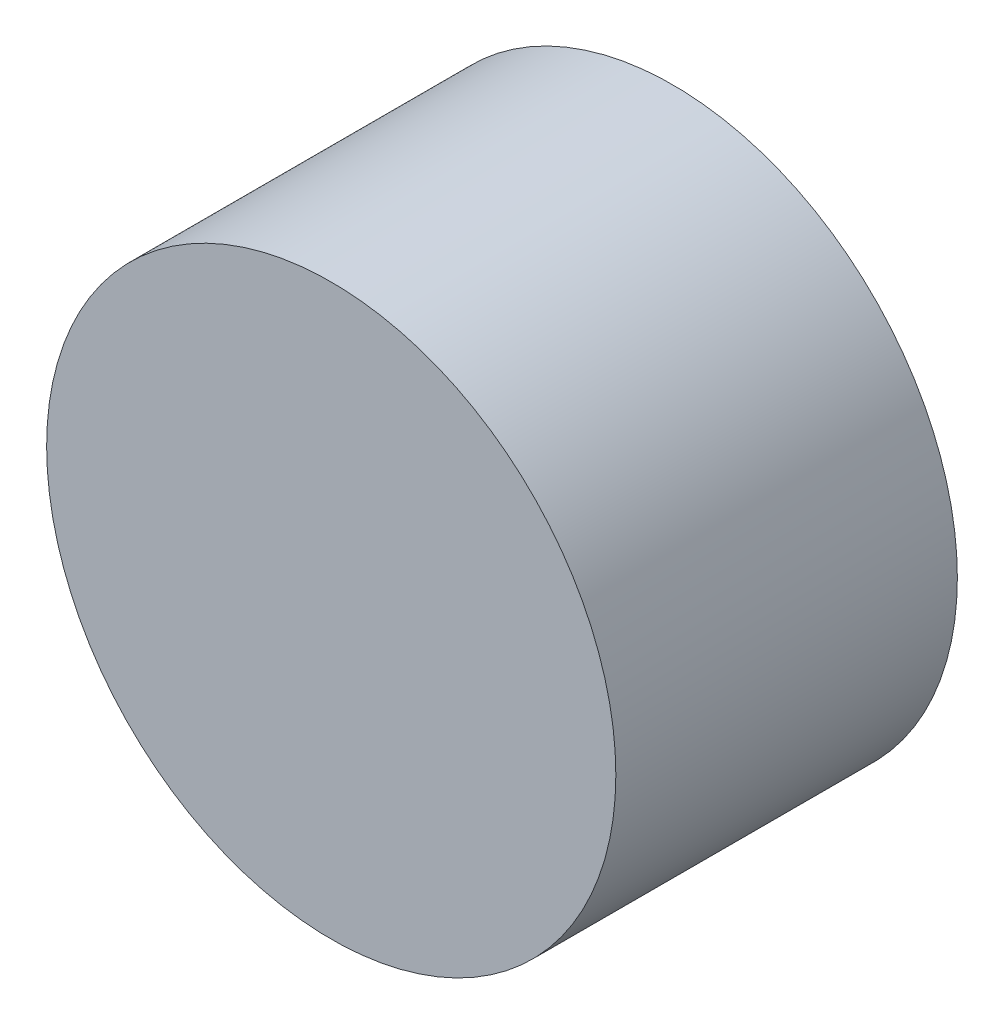
ISO-10303-21;
HEADER;
FILE_DESCRIPTION(('STEP AP214'),'2;1');
FILE_NAME('part.step','',(''),(''),'','','');
FILE_SCHEMA(('AUTOMOTIVE_DESIGN { 1 0 10303 214 1 1 1 1 }'));
ENDSEC;
DATA;
#1=APPLICATION_CONTEXT('core data for automotive mechanical design processes');
#2=APPLICATION_PROTOCOL_DEFINITION('international standard','automotive_design',2000,#1);
#3=PRODUCT_CONTEXT('',#1,'mechanical');
#4=PRODUCT('Part','Part','',(#3));
#5=PRODUCT_RELATED_PRODUCT_CATEGORY('part','',(#4));
#6=PRODUCT_DEFINITION_FORMATION('','',#4);
#7=PRODUCT_DEFINITION_CONTEXT('part definition',#1,'design');
#8=PRODUCT_DEFINITION('design','',#6,#7);
#9=PRODUCT_DEFINITION_SHAPE('','',#8);
#10=(LENGTH_UNIT() NAMED_UNIT(*) SI_UNIT(.MILLI.,.METRE.));
#11=(NAMED_UNIT(*) PLANE_ANGLE_UNIT() SI_UNIT($,.RADIAN.));
#12=(NAMED_UNIT(*) SI_UNIT($,.STERADIAN.) SOLID_ANGLE_UNIT());
#13=UNCERTAINTY_MEASURE_WITH_UNIT(LENGTH_MEASURE(1.E-05),#10,'distance_accuracy_value','');
#14=(GEOMETRIC_REPRESENTATION_CONTEXT(3) GLOBAL_UNCERTAINTY_ASSIGNED_CONTEXT((#13)) GLOBAL_UNIT_ASSIGNED_CONTEXT((#10,
#11,#12)) REPRESENTATION_CONTEXT('',''));
#15=CARTESIAN_POINT('',(0.,0.,0.));
#16=DIRECTION('',(0.,0.,1.));
#17=DIRECTION('',(1.,0.,0.));
#18=AXIS2_PLACEMENT_3D('',#15,#16,#17);
#19=CARTESIAN_POINT('',(0.,0.,30.));
#20=DIRECTION('',(0.,0.,-1.));
#21=DIRECTION('',(-1.,0.,0.));
#22=AXIS2_PLACEMENT_3D('',#19,#20,#21);
#23=CYLINDRICAL_SURFACE('',#22,25.);
#24=CARTESIAN_POINT('',(0.,0.,30.));
#25=DIRECTION('',(0.,0.,1.));
#26=DIRECTION('',(1.,0.,0.));
#27=AXIS2_PLACEMENT_3D('',#24,#25,#26);
#28=CIRCLE('',#27,25.);
#29=CARTESIAN_POINT('',(25.,0.,30.));
#30=VERTEX_POINT('',#29);
#31=EDGE_CURVE('E10',#30,#30,#28,.T.);
#32=ORIENTED_EDGE('',*,*,#31,.F.);
#33=EDGE_LOOP('',(#32));
#34=FACE_BOUND('',#33,.T.);
#35=CARTESIAN_POINT('',(0.,0.,0.));
#36=DIRECTION('',(0.,0.,1.));
#37=DIRECTION('',(1.,0.,0.));
#38=AXIS2_PLACEMENT_3D('',#35,#36,#37);
#39=CIRCLE('',#38,25.);
#40=CARTESIAN_POINT('',(25.,0.,0.));
#41=VERTEX_POINT('',#40);
#42=EDGE_CURVE('E34',#41,#41,#39,.T.);
#43=ORIENTED_EDGE('',*,*,#42,.T.);
#44=EDGE_LOOP('',(#43));
#45=FACE_BOUND('',#44,.T.);
#46=ADVANCED_FACE('F31',(#34,#45),#23,.T.);
#47=CARTESIAN_POINT('',(0.,0.,30.));
#48=DIRECTION('',(0.,0.,1.));
#49=DIRECTION('',(1.,0.,0.));
#50=AXIS2_PLACEMENT_3D('',#47,#48,#49);
#51=PLANE('',#50);
#52=ORIENTED_EDGE('',*,*,#31,.T.);
#53=EDGE_LOOP('',(#52));
#54=FACE_BOUND('',#53,.T.);
#55=ADVANCED_FACE('F46',(#54),#51,.T.);
#56=CARTESIAN_POINT('',(0.,0.,0.));
#57=DIRECTION('',(0.,0.,1.));
#58=DIRECTION('',(1.,0.,0.));
#59=AXIS2_PLACEMENT_3D('',#56,#57,#58);
#60=PLANE('',#59);
#61=ORIENTED_EDGE('',*,*,#42,.F.);
#62=EDGE_LOOP('',(#61));
#63=FACE_BOUND('',#62,.T.);
#64=ADVANCED_FACE('F44',(#63),#60,.F.);
#65=CLOSED_SHELL('',(#46,#55,#64));
#66=MANIFOLD_SOLID_BREP('B2',#65);
#67=ADVANCED_BREP_SHAPE_REPRESENTATION('',(#18,#66),#14);
#68=SHAPE_DEFINITION_REPRESENTATION(#9,#67);
ENDSEC;
END-ISO-10303-21;
